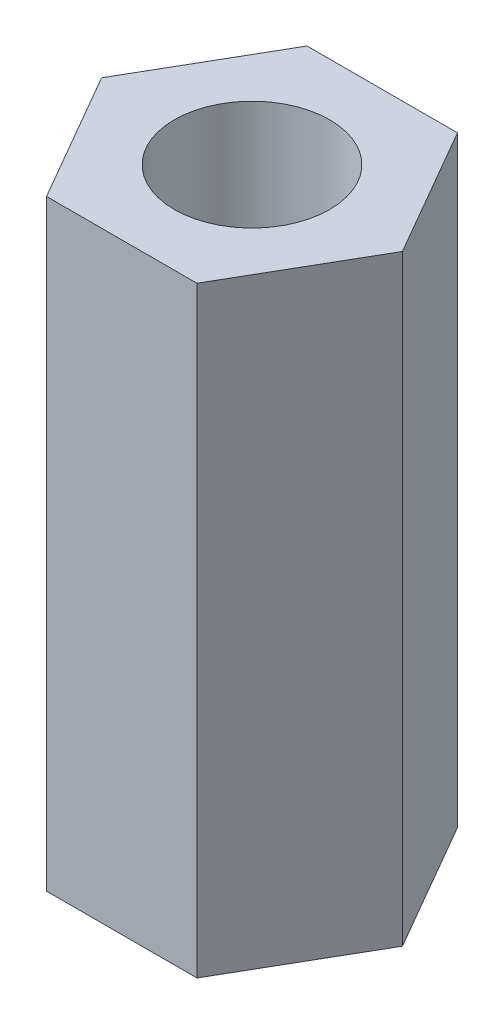
ISO-10303-21;
HEADER;
FILE_DESCRIPTION(('STEP AP214'),'2;1');
FILE_NAME('part.step','',(''),(''),'','','');
FILE_SCHEMA(('AUTOMOTIVE_DESIGN { 1 0 10303 214 1 1 1 1 }'));
ENDSEC;
DATA;
#1=APPLICATION_CONTEXT('core data for automotive mechanical design processes');
#2=APPLICATION_PROTOCOL_DEFINITION('international standard','automotive_design',2000,#1);
#3=PRODUCT_CONTEXT('',#1,'mechanical');
#4=PRODUCT('Part','Part','',(#3));
#5=PRODUCT_RELATED_PRODUCT_CATEGORY('part','',(#4));
#6=PRODUCT_DEFINITION_FORMATION('','',#4);
#7=PRODUCT_DEFINITION_CONTEXT('part definition',#1,'design');
#8=PRODUCT_DEFINITION('design','',#6,#7);
#9=PRODUCT_DEFINITION_SHAPE('','',#8);
#10=(LENGTH_UNIT() NAMED_UNIT(*) SI_UNIT(.MILLI.,.METRE.));
#11=(NAMED_UNIT(*) PLANE_ANGLE_UNIT() SI_UNIT($,.RADIAN.));
#12=(NAMED_UNIT(*) SI_UNIT($,.STERADIAN.) SOLID_ANGLE_UNIT());
#13=UNCERTAINTY_MEASURE_WITH_UNIT(LENGTH_MEASURE(1.E-05),#10,'distance_accuracy_value','');
#14=(GEOMETRIC_REPRESENTATION_CONTEXT(3) GLOBAL_UNCERTAINTY_ASSIGNED_CONTEXT((#13)) GLOBAL_UNIT_ASSIGNED_CONTEXT((#10,
#11,#12)) REPRESENTATION_CONTEXT('',''));
#15=CARTESIAN_POINT('',(0.,0.,0.));
#16=DIRECTION('',(0.,0.,1.));
#17=DIRECTION('',(1.,0.,0.));
#18=AXIS2_PLACEMENT_3D('',#15,#16,#17);
#19=CARTESIAN_POINT('',(1.25000000000002,10.,2.16506350946108));
#20=DIRECTION('',(-0.866025403784442,0.,-0.499999999999995));
#21=DIRECTION('',(-0.499999999999995,0.,0.866025403784442));
#22=AXIS2_PLACEMENT_3D('',#19,#20,#21);
#23=PLANE('',#22);
#24=DIRECTION('',(0.499999999999995,0.,-0.866025403784441));
#25=VECTOR('',#24,1.);
#26=CARTESIAN_POINT('',(1.25000000000002,0.,2.16506350946108));
#27=LINE('',#26,#25);
#28=CARTESIAN_POINT('',(1.25000000000002,0.,2.16506350946108));
#29=VERTEX_POINT('',#28);
#30=CARTESIAN_POINT('',(2.5,0.,0.));
#31=VERTEX_POINT('',#30);
#32=EDGE_CURVE('E117',#29,#31,#27,.T.);
#33=ORIENTED_EDGE('',*,*,#32,.T.);
#34=DIRECTION('',(0.,-1.,0.));
#35=VECTOR('',#34,1.);
#36=CARTESIAN_POINT('',(2.5,10.,0.));
#37=LINE('',#36,#35);
#38=CARTESIAN_POINT('',(2.5,10.,0.));
#39=VERTEX_POINT('',#38);
#40=EDGE_CURVE('E11',#39,#31,#37,.T.);
#41=ORIENTED_EDGE('',*,*,#40,.F.);
#42=DIRECTION('',(0.499999999999995,0.,-0.866025403784441));
#43=VECTOR('',#42,1.);
#44=CARTESIAN_POINT('',(1.25000000000002,10.,2.16506350946108));
#45=LINE('',#44,#43);
#46=CARTESIAN_POINT('',(1.25000000000002,10.,2.16506350946108));
#47=VERTEX_POINT('',#46);
#48=EDGE_CURVE('E128',#47,#39,#45,.T.);
#49=ORIENTED_EDGE('',*,*,#48,.F.);
#50=DIRECTION('',(0.,-1.,0.));
#51=VECTOR('',#50,1.);
#52=CARTESIAN_POINT('',(1.25000000000002,10.,2.16506350946108));
#53=LINE('',#52,#51);
#54=EDGE_CURVE('E113',#47,#29,#53,.T.);
#55=ORIENTED_EDGE('',*,*,#54,.T.);
#56=EDGE_LOOP('',(#33,#41,#49,#55));
#57=FACE_BOUND('',#56,.T.);
#58=ADVANCED_FACE('F33',(#57),#23,.F.);
#59=CARTESIAN_POINT('',(2.5,10.,0.));
#60=DIRECTION('',(-0.866025403784438,0.,0.500000000000001));
#61=DIRECTION('',(0.500000000000001,0.,0.866025403784438));
#62=AXIS2_PLACEMENT_3D('',#59,#60,#61);
#63=PLANE('',#62);
#64=DIRECTION('',(-0.500000000000001,0.,-0.866025403784438));
#65=VECTOR('',#64,1.);
#66=CARTESIAN_POINT('',(2.5,0.,0.));
#67=LINE('',#66,#65);
#68=CARTESIAN_POINT('',(1.24999999999999,0.,-2.1650635094611));
#69=VERTEX_POINT('',#68);
#70=EDGE_CURVE('E120',#31,#69,#67,.T.);
#71=ORIENTED_EDGE('',*,*,#70,.T.);
#72=DIRECTION('',(0.,-1.,0.));
#73=VECTOR('',#72,1.);
#74=CARTESIAN_POINT('',(1.24999999999999,10.,-2.1650635094611));
#75=LINE('',#74,#73);
#76=CARTESIAN_POINT('',(1.24999999999999,10.,-2.1650635094611));
#77=VERTEX_POINT('',#76);
#78=EDGE_CURVE('E41',#77,#69,#75,.T.);
#79=ORIENTED_EDGE('',*,*,#78,.F.);
#80=DIRECTION('',(-0.500000000000001,0.,-0.866025403784438));
#81=VECTOR('',#80,1.);
#82=CARTESIAN_POINT('',(2.5,10.,0.));
#83=LINE('',#82,#81);
#84=EDGE_CURVE('E86',#39,#77,#83,.T.);
#85=ORIENTED_EDGE('',*,*,#84,.F.);
#86=ORIENTED_EDGE('',*,*,#40,.T.);
#87=EDGE_LOOP('',(#71,#79,#85,#86));
#88=FACE_BOUND('',#87,.T.);
#89=ADVANCED_FACE('F153',(#88),#63,.F.);
#90=CARTESIAN_POINT('',(1.24999999999999,10.,-2.1650635094611));
#91=DIRECTION('',(0.,0.,1.));
#92=DIRECTION('',(1.,0.,0.));
#93=AXIS2_PLACEMENT_3D('',#90,#91,#92);
#94=PLANE('',#93);
#95=DIRECTION('',(-1.,0.,0.));
#96=VECTOR('',#95,1.);
#97=CARTESIAN_POINT('',(1.24999999999999,0.,-2.1650635094611));
#98=LINE('',#97,#96);
#99=CARTESIAN_POINT('',(-1.25000000000001,0.,-2.16506350946109));
#100=VERTEX_POINT('',#99);
#101=EDGE_CURVE('E123',#69,#100,#98,.T.);
#102=ORIENTED_EDGE('',*,*,#101,.T.);
#103=DIRECTION('',(0.,-1.,0.));
#104=VECTOR('',#103,1.);
#105=CARTESIAN_POINT('',(-1.25000000000001,10.,-2.16506350946109));
#106=LINE('',#105,#104);
#107=CARTESIAN_POINT('',(-1.25000000000001,10.,-2.16506350946109));
#108=VERTEX_POINT('',#107);
#109=EDGE_CURVE('E108',#108,#100,#106,.T.);
#110=ORIENTED_EDGE('',*,*,#109,.F.);
#111=DIRECTION('',(-1.,0.,0.));
#112=VECTOR('',#111,1.);
#113=CARTESIAN_POINT('',(1.24999999999999,10.,-2.1650635094611));
#114=LINE('',#113,#112);
#115=EDGE_CURVE('E99',#77,#108,#114,.T.);
#116=ORIENTED_EDGE('',*,*,#115,.F.);
#117=ORIENTED_EDGE('',*,*,#78,.T.);
#118=EDGE_LOOP('',(#102,#110,#116,#117));
#119=FACE_BOUND('',#118,.T.);
#120=ADVANCED_FACE('F134',(#119),#94,.F.);
#121=CARTESIAN_POINT('',(-1.25000000000001,10.,-2.16506350946109));
#122=DIRECTION('',(0.866025403784441,0.,0.499999999999995));
#123=DIRECTION('',(0.499999999999995,0.,-0.866025403784441));
#124=AXIS2_PLACEMENT_3D('',#121,#122,#123);
#125=PLANE('',#124);
#126=DIRECTION('',(-0.499999999999995,0.,0.866025403784441));
#127=VECTOR('',#126,1.);
#128=CARTESIAN_POINT('',(-1.25000000000001,0.,-2.16506350946109));
#129=LINE('',#128,#127);
#130=CARTESIAN_POINT('',(-2.5,0.,0.));
#131=VERTEX_POINT('',#130);
#132=EDGE_CURVE('E107',#100,#131,#129,.T.);
#133=ORIENTED_EDGE('',*,*,#132,.T.);
#134=DIRECTION('',(0.,-1.,0.));
#135=VECTOR('',#134,1.);
#136=CARTESIAN_POINT('',(-2.5,10.,0.));
#137=LINE('',#136,#135);
#138=CARTESIAN_POINT('',(-2.5,10.,0.));
#139=VERTEX_POINT('',#138);
#140=EDGE_CURVE('E104',#139,#131,#137,.T.);
#141=ORIENTED_EDGE('',*,*,#140,.F.);
#142=DIRECTION('',(-0.499999999999995,0.,0.866025403784441));
#143=VECTOR('',#142,1.);
#144=CARTESIAN_POINT('',(-1.25000000000001,10.,-2.16506350946109));
#145=LINE('',#144,#143);
#146=EDGE_CURVE('E93',#108,#139,#145,.T.);
#147=ORIENTED_EDGE('',*,*,#146,.F.);
#148=ORIENTED_EDGE('',*,*,#109,.T.);
#149=EDGE_LOOP('',(#133,#141,#147,#148));
#150=FACE_BOUND('',#149,.T.);
#151=ADVANCED_FACE('F105',(#150),#125,.F.);
#152=CARTESIAN_POINT('',(-2.5,10.,0.));
#153=DIRECTION('',(0.866025403784434,0.,-0.500000000000007));
#154=DIRECTION('',(-0.500000000000007,0.,-0.866025403784435));
#155=AXIS2_PLACEMENT_3D('',#152,#153,#154);
#156=PLANE('',#155);
#157=DIRECTION('',(0.500000000000007,0.,0.866025403784434));
#158=VECTOR('',#157,1.);
#159=CARTESIAN_POINT('',(-2.5,0.,0.));
#160=LINE('',#159,#158);
#161=CARTESIAN_POINT('',(-1.24999999999998,0.,2.1650635094611));
#162=VERTEX_POINT('',#161);
#163=EDGE_CURVE('E72',#131,#162,#160,.T.);
#164=ORIENTED_EDGE('',*,*,#163,.T.);
#165=DIRECTION('',(0.,-1.,0.));
#166=VECTOR('',#165,1.);
#167=CARTESIAN_POINT('',(-1.24999999999998,10.,2.1650635094611));
#168=LINE('',#167,#166);
#169=CARTESIAN_POINT('',(-1.24999999999998,10.,2.1650635094611));
#170=VERTEX_POINT('',#169);
#171=EDGE_CURVE('E109',#170,#162,#168,.T.);
#172=ORIENTED_EDGE('',*,*,#171,.F.);
#173=DIRECTION('',(0.500000000000007,0.,0.866025403784434));
#174=VECTOR('',#173,1.);
#175=CARTESIAN_POINT('',(-2.5,10.,0.));
#176=LINE('',#175,#174);
#177=EDGE_CURVE('E97',#139,#170,#176,.T.);
#178=ORIENTED_EDGE('',*,*,#177,.F.);
#179=ORIENTED_EDGE('',*,*,#140,.T.);
#180=EDGE_LOOP('',(#164,#172,#178,#179));
#181=FACE_BOUND('',#180,.T.);
#182=ADVANCED_FACE('F111',(#181),#156,.F.);
#183=CARTESIAN_POINT('',(-1.24999999999998,10.,2.1650635094611));
#184=DIRECTION('',(0.,0.,-1.));
#185=DIRECTION('',(-1.,0.,0.));
#186=AXIS2_PLACEMENT_3D('',#183,#184,#185);
#187=PLANE('',#186);
#188=DIRECTION('',(1.,0.,0.));
#189=VECTOR('',#188,1.);
#190=CARTESIAN_POINT('',(-1.24999999999998,0.,2.1650635094611));
#191=LINE('',#190,#189);
#192=EDGE_CURVE('E78',#162,#29,#191,.T.);
#193=ORIENTED_EDGE('',*,*,#192,.T.);
#194=ORIENTED_EDGE('',*,*,#54,.F.);
#195=DIRECTION('',(1.,0.,0.));
#196=VECTOR('',#195,1.);
#197=CARTESIAN_POINT('',(-1.24999999999998,10.,2.1650635094611));
#198=LINE('',#197,#196);
#199=EDGE_CURVE('E49',#170,#47,#198,.T.);
#200=ORIENTED_EDGE('',*,*,#199,.F.);
#201=ORIENTED_EDGE('',*,*,#171,.T.);
#202=EDGE_LOOP('',(#193,#194,#200,#201));
#203=FACE_BOUND('',#202,.T.);
#204=ADVANCED_FACE('F141',(#203),#187,.F.);
#205=CARTESIAN_POINT('',(0.,10.,0.));
#206=DIRECTION('',(0.,1.,0.));
#207=DIRECTION('',(0.,0.,1.));
#208=AXIS2_PLACEMENT_3D('',#205,#206,#207);
#209=PLANE('',#208);
#210=CARTESIAN_POINT('',(0.,10.,0.));
#211=DIRECTION('',(0.,1.,0.));
#212=DIRECTION('',(0.,0.,1.));
#213=AXIS2_PLACEMENT_3D('',#210,#211,#212);
#214=CIRCLE('',#213,1.29191785356696);
#215=CARTESIAN_POINT('',(0.,10.,1.29191785356696));
#216=VERTEX_POINT('',#215);
#217=EDGE_CURVE('E208',#216,#216,#214,.T.);
#218=ORIENTED_EDGE('',*,*,#217,.F.);
#219=EDGE_LOOP('',(#218));
#220=FACE_BOUND('',#219,.T.);
#221=ORIENTED_EDGE('',*,*,#48,.T.);
#222=ORIENTED_EDGE('',*,*,#84,.T.);
#223=ORIENTED_EDGE('',*,*,#115,.T.);
#224=ORIENTED_EDGE('',*,*,#146,.T.);
#225=ORIENTED_EDGE('',*,*,#177,.T.);
#226=ORIENTED_EDGE('',*,*,#199,.T.);
#227=EDGE_LOOP('',(#221,#222,#223,#224,#225,#226));
#228=FACE_BOUND('',#227,.T.);
#229=ADVANCED_FACE('F95',(#220,#228),#209,.T.);
#230=CARTESIAN_POINT('',(0.,0.,0.));
#231=DIRECTION('',(0.,1.,0.));
#232=DIRECTION('',(0.,0.,1.));
#233=AXIS2_PLACEMENT_3D('',#230,#231,#232);
#234=PLANE('',#233);
#235=CARTESIAN_POINT('',(0.,0.,0.));
#236=DIRECTION('',(0.,1.,0.));
#237=DIRECTION('',(0.,0.,1.));
#238=AXIS2_PLACEMENT_3D('',#235,#236,#237);
#239=CIRCLE('',#238,1.29191785356696);
#240=CARTESIAN_POINT('',(0.,0.,1.29191785356696));
#241=VERTEX_POINT('',#240);
#242=EDGE_CURVE('E121',#241,#241,#239,.T.);
#243=ORIENTED_EDGE('',*,*,#242,.T.);
#244=EDGE_LOOP('',(#243));
#245=FACE_BOUND('',#244,.T.);
#246=ORIENTED_EDGE('',*,*,#32,.F.);
#247=ORIENTED_EDGE('',*,*,#192,.F.);
#248=ORIENTED_EDGE('',*,*,#163,.F.);
#249=ORIENTED_EDGE('',*,*,#132,.F.);
#250=ORIENTED_EDGE('',*,*,#101,.F.);
#251=ORIENTED_EDGE('',*,*,#70,.F.);
#252=EDGE_LOOP('',(#246,#247,#248,#249,#250,#251));
#253=FACE_BOUND('',#252,.T.);
#254=ADVANCED_FACE('F137',(#245,#253),#234,.F.);
#255=CARTESIAN_POINT('',(0.,0.,0.));
#256=DIRECTION('',(0.,1.,0.));
#257=DIRECTION('',(0.,0.,1.));
#258=AXIS2_PLACEMENT_3D('',#255,#256,#257);
#259=CYLINDRICAL_SURFACE('',#258,1.29191785356696);
#260=ORIENTED_EDGE('',*,*,#242,.F.);
#261=EDGE_LOOP('',(#260));
#262=FACE_BOUND('',#261,.T.);
#263=ORIENTED_EDGE('',*,*,#217,.T.);
#264=EDGE_LOOP('',(#263));
#265=FACE_BOUND('',#264,.T.);
#266=ADVANCED_FACE('F190',(#262,#265),#259,.F.);
#267=CLOSED_SHELL('',(#58,#89,#120,#151,#182,#204,#229,#254,#266));
#268=MANIFOLD_SOLID_BREP('B2',#267);
#269=ADVANCED_BREP_SHAPE_REPRESENTATION('',(#18,#268),#14);
#270=SHAPE_DEFINITION_REPRESENTATION(#9,#269);
ENDSEC;
END-ISO-10303-21;
